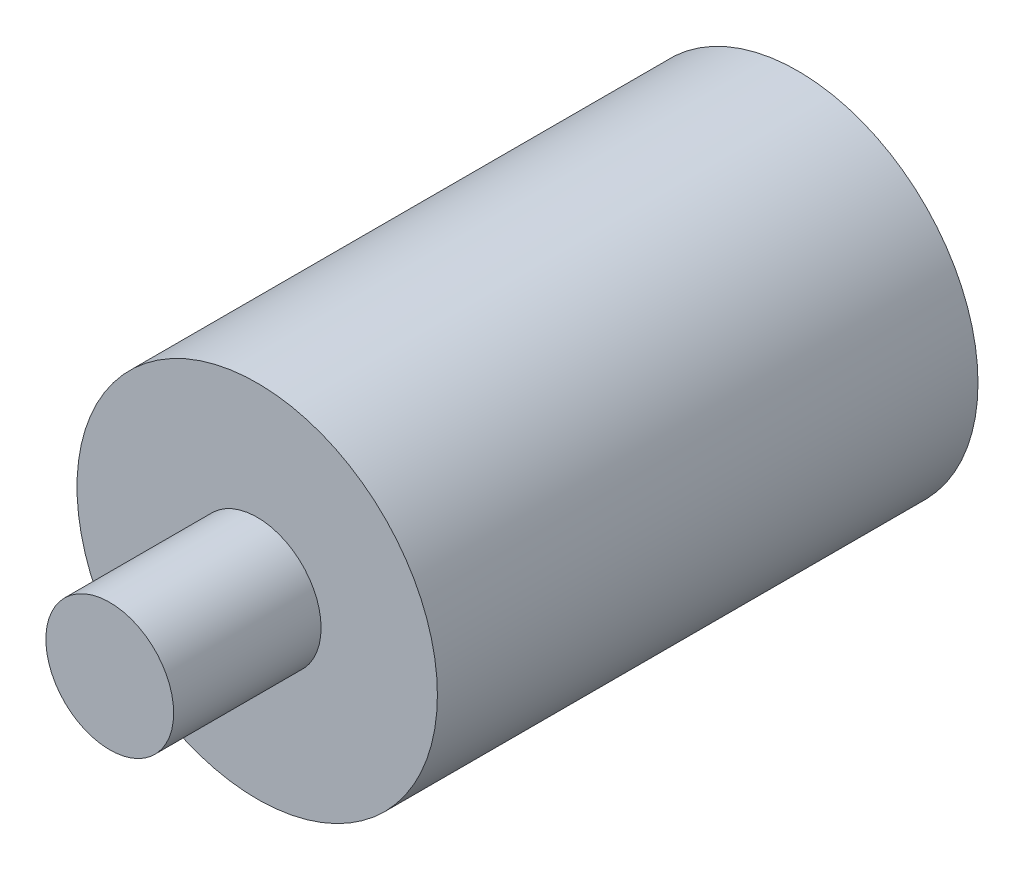
ISO-10303-21;
HEADER;
FILE_DESCRIPTION(('STEP AP214'),'2;1');
FILE_NAME('part.step','',(''),(''),'','','');
FILE_SCHEMA(('AUTOMOTIVE_DESIGN { 1 0 10303 214 1 1 1 1 }'));
ENDSEC;
DATA;
#1=APPLICATION_CONTEXT('core data for automotive mechanical design processes');
#2=APPLICATION_PROTOCOL_DEFINITION('international standard','automotive_design',2000,#1);
#3=PRODUCT_CONTEXT('',#1,'mechanical');
#4=PRODUCT('Part','Part','',(#3));
#5=PRODUCT_RELATED_PRODUCT_CATEGORY('part','',(#4));
#6=PRODUCT_DEFINITION_FORMATION('','',#4);
#7=PRODUCT_DEFINITION_CONTEXT('part definition',#1,'design');
#8=PRODUCT_DEFINITION('design','',#6,#7);
#9=PRODUCT_DEFINITION_SHAPE('','',#8);
#10=(LENGTH_UNIT() NAMED_UNIT(*) SI_UNIT(.MILLI.,.METRE.));
#11=(NAMED_UNIT(*) PLANE_ANGLE_UNIT() SI_UNIT($,.RADIAN.));
#12=(NAMED_UNIT(*) SI_UNIT($,.STERADIAN.) SOLID_ANGLE_UNIT());
#13=UNCERTAINTY_MEASURE_WITH_UNIT(LENGTH_MEASURE(1.E-05),#10,'distance_accuracy_value','');
#14=(GEOMETRIC_REPRESENTATION_CONTEXT(3) GLOBAL_UNCERTAINTY_ASSIGNED_CONTEXT((#13)) GLOBAL_UNIT_ASSIGNED_CONTEXT((#10,
#11,#12)) REPRESENTATION_CONTEXT('',''));
#15=CARTESIAN_POINT('',(0.,0.,0.));
#16=DIRECTION('',(0.,0.,1.));
#17=DIRECTION('',(1.,0.,0.));
#18=AXIS2_PLACEMENT_3D('',#15,#16,#17);
#19=CARTESIAN_POINT('',(0.,0.,33.));
#20=DIRECTION('',(0.,0.,-1.));
#21=DIRECTION('',(-1.,0.,0.));
#22=AXIS2_PLACEMENT_3D('',#19,#20,#21);
#23=CYLINDRICAL_SURFACE('',#22,11.);
#24=CARTESIAN_POINT('',(0.,0.,33.));
#25=DIRECTION('',(0.,0.,1.));
#26=DIRECTION('',(1.,0.,0.));
#27=AXIS2_PLACEMENT_3D('',#24,#25,#26);
#28=CIRCLE('',#27,11.);
#29=CARTESIAN_POINT('',(11.,0.,33.));
#30=VERTEX_POINT('',#29);
#31=EDGE_CURVE('E39',#30,#30,#28,.T.);
#32=ORIENTED_EDGE('',*,*,#31,.F.);
#33=EDGE_LOOP('',(#32));
#34=FACE_BOUND('',#33,.T.);
#35=CARTESIAN_POINT('',(0.,0.,0.));
#36=DIRECTION('',(0.,0.,1.));
#37=DIRECTION('',(1.,0.,0.));
#38=AXIS2_PLACEMENT_3D('',#35,#36,#37);
#39=CIRCLE('',#38,11.);
#40=CARTESIAN_POINT('',(11.,0.,0.));
#41=VERTEX_POINT('',#40);
#42=EDGE_CURVE('E35',#41,#41,#39,.T.);
#43=ORIENTED_EDGE('',*,*,#42,.T.);
#44=EDGE_LOOP('',(#43));
#45=FACE_BOUND('',#44,.T.);
#46=ADVANCED_FACE('F32',(#34,#45),#23,.T.);
#47=CARTESIAN_POINT('',(0.,0.,33.));
#48=DIRECTION('',(0.,0.,1.));
#49=DIRECTION('',(1.,0.,0.));
#50=AXIS2_PLACEMENT_3D('',#47,#48,#49);
#51=PLANE('',#50);
#52=CARTESIAN_POINT('',(0.,0.,33.));
#53=DIRECTION('',(0.,0.,1.));
#54=DIRECTION('',(1.,0.,0.));
#55=AXIS2_PLACEMENT_3D('',#52,#53,#54);
#56=CIRCLE('',#55,3.9);
#57=CARTESIAN_POINT('',(3.9,0.,33.));
#58=VERTEX_POINT('',#57);
#59=EDGE_CURVE('E10',#58,#58,#56,.T.);
#60=ORIENTED_EDGE('',*,*,#59,.F.);
#61=EDGE_LOOP('',(#60));
#62=FACE_BOUND('',#61,.T.);
#63=ORIENTED_EDGE('',*,*,#31,.T.);
#64=EDGE_LOOP('',(#63));
#65=FACE_BOUND('',#64,.T.);
#66=ADVANCED_FACE('F56',(#62,#65),#51,.T.);
#67=CARTESIAN_POINT('',(0.,0.,0.));
#68=DIRECTION('',(0.,0.,1.));
#69=DIRECTION('',(1.,0.,0.));
#70=AXIS2_PLACEMENT_3D('',#67,#68,#69);
#71=PLANE('',#70);
#72=ORIENTED_EDGE('',*,*,#42,.F.);
#73=EDGE_LOOP('',(#72));
#74=FACE_BOUND('',#73,.T.);
#75=ADVANCED_FACE('F53',(#74),#71,.F.);
#76=CARTESIAN_POINT('',(0.,0.,42.));
#77=DIRECTION('',(0.,0.,-1.));
#78=DIRECTION('',(-1.,0.,0.));
#79=AXIS2_PLACEMENT_3D('',#76,#77,#78);
#80=CYLINDRICAL_SURFACE('',#79,3.9);
#81=CARTESIAN_POINT('',(0.,0.,42.));
#82=DIRECTION('',(0.,0.,1.));
#83=DIRECTION('',(1.,0.,0.));
#84=AXIS2_PLACEMENT_3D('',#81,#82,#83);
#85=CIRCLE('',#84,3.9);
#86=CARTESIAN_POINT('',(3.9,0.,42.));
#87=VERTEX_POINT('',#86);
#88=EDGE_CURVE('E45',#87,#87,#85,.T.);
#89=ORIENTED_EDGE('',*,*,#88,.F.);
#90=EDGE_LOOP('',(#89));
#91=FACE_BOUND('',#90,.T.);
#92=ORIENTED_EDGE('',*,*,#59,.T.);
#93=EDGE_LOOP('',(#92));
#94=FACE_BOUND('',#93,.T.);
#95=ADVANCED_FACE('F55',(#91,#94),#80,.T.);
#96=CARTESIAN_POINT('',(0.,0.,42.));
#97=DIRECTION('',(0.,0.,1.));
#98=DIRECTION('',(1.,0.,0.));
#99=AXIS2_PLACEMENT_3D('',#96,#97,#98);
#100=PLANE('',#99);
#101=ORIENTED_EDGE('',*,*,#88,.T.);
#102=EDGE_LOOP('',(#101));
#103=FACE_BOUND('',#102,.T.);
#104=ADVANCED_FACE('F61',(#103),#100,.T.);
#105=CLOSED_SHELL('',(#46,#66,#75,#95,#104));
#106=MANIFOLD_SOLID_BREP('B2',#105);
#107=ADVANCED_BREP_SHAPE_REPRESENTATION('',(#18,#106),#14);
#108=SHAPE_DEFINITION_REPRESENTATION(#9,#107);
ENDSEC;
END-ISO-10303-21;
